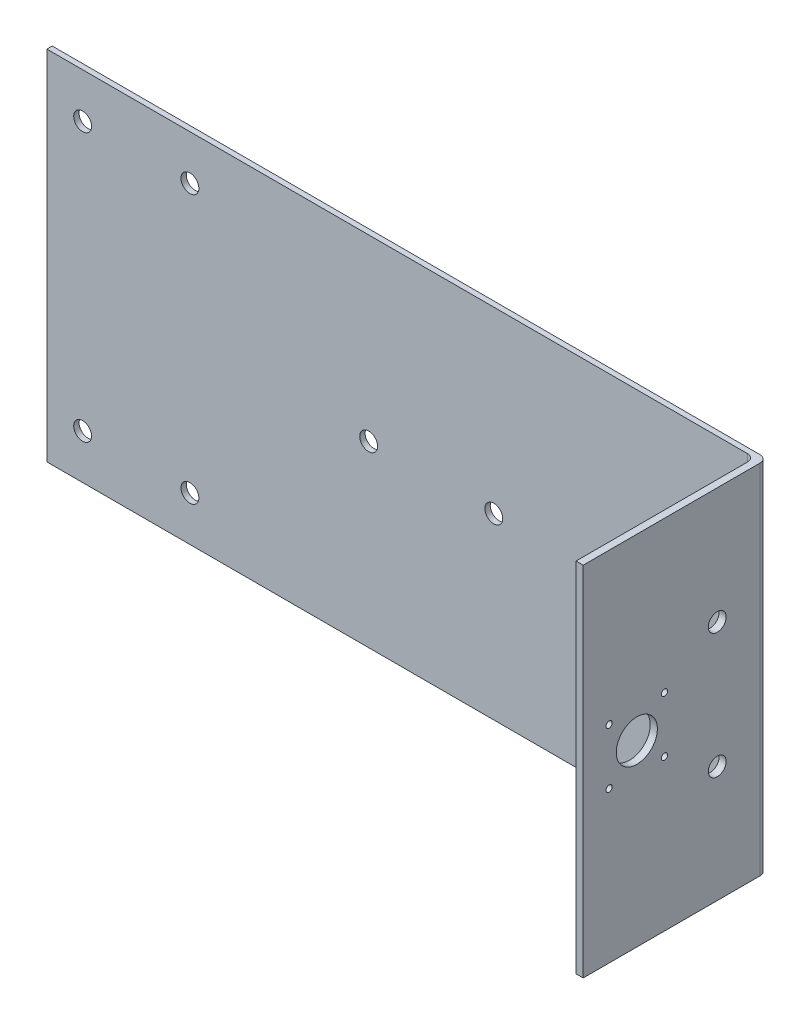
ISO-10303-21;
HEADER;
FILE_DESCRIPTION(('STEP AP214'),'2;1');
FILE_NAME('part.step','',(''),(''),'','','');
FILE_SCHEMA(('AUTOMOTIVE_DESIGN { 1 0 10303 214 1 1 1 1 }'));
ENDSEC;
DATA;
#1=APPLICATION_CONTEXT('core data for automotive mechanical design processes');
#2=APPLICATION_PROTOCOL_DEFINITION('international standard','automotive_design',2000,#1);
#3=PRODUCT_CONTEXT('',#1,'mechanical');
#4=PRODUCT('Part','Part','',(#3));
#5=PRODUCT_RELATED_PRODUCT_CATEGORY('part','',(#4));
#6=PRODUCT_DEFINITION_FORMATION('','',#4);
#7=PRODUCT_DEFINITION_CONTEXT('part definition',#1,'design');
#8=PRODUCT_DEFINITION('design','',#6,#7);
#9=PRODUCT_DEFINITION_SHAPE('','',#8);
#10=(LENGTH_UNIT() NAMED_UNIT(*) SI_UNIT(.MILLI.,.METRE.));
#11=(NAMED_UNIT(*) PLANE_ANGLE_UNIT() SI_UNIT($,.RADIAN.));
#12=(NAMED_UNIT(*) SI_UNIT($,.STERADIAN.) SOLID_ANGLE_UNIT());
#13=UNCERTAINTY_MEASURE_WITH_UNIT(LENGTH_MEASURE(1.E-05),#10,'distance_accuracy_value','');
#14=(GEOMETRIC_REPRESENTATION_CONTEXT(3) GLOBAL_UNCERTAINTY_ASSIGNED_CONTEXT((#13)) GLOBAL_UNIT_ASSIGNED_CONTEXT((#10,
#11,#12)) REPRESENTATION_CONTEXT('',''));
#15=CARTESIAN_POINT('',(0.,0.,0.));
#16=DIRECTION('',(0.,0.,1.));
#17=DIRECTION('',(1.,0.,0.));
#18=AXIS2_PLACEMENT_3D('',#15,#16,#17);
#19=CARTESIAN_POINT('',(-200.,-100.,3.));
#20=DIRECTION('',(1.,0.,0.));
#21=DIRECTION('',(0.,0.,-1.));
#22=AXIS2_PLACEMENT_3D('',#19,#20,#21);
#23=PLANE('',#22);
#24=DIRECTION('',(0.,-1.,0.));
#25=VECTOR('',#24,1.);
#26=CARTESIAN_POINT('',(-200.,-100.,0.));
#27=LINE('',#26,#25);
#28=CARTESIAN_POINT('',(-200.,100.,0.));
#29=VERTEX_POINT('',#28);
#30=CARTESIAN_POINT('',(-200.,-100.,0.));
#31=VERTEX_POINT('',#30);
#32=EDGE_CURVE('E229',#29,#31,#27,.T.);
#33=ORIENTED_EDGE('',*,*,#32,.T.);
#34=DIRECTION('',(0.,0.,-1.));
#35=VECTOR('',#34,1.);
#36=CARTESIAN_POINT('',(-200.,-100.,3.));
#37=LINE('',#36,#35);
#38=CARTESIAN_POINT('',(-200.,-100.,3.));
#39=VERTEX_POINT('',#38);
#40=EDGE_CURVE('E259',#39,#31,#37,.T.);
#41=ORIENTED_EDGE('',*,*,#40,.F.);
#42=DIRECTION('',(0.,-1.,0.));
#43=VECTOR('',#42,1.);
#44=CARTESIAN_POINT('',(-200.,-100.,3.));
#45=LINE('',#44,#43);
#46=CARTESIAN_POINT('',(-200.,100.,3.));
#47=VERTEX_POINT('',#46);
#48=EDGE_CURVE('E230',#47,#39,#45,.T.);
#49=ORIENTED_EDGE('',*,*,#48,.F.);
#50=DIRECTION('',(0.,0.,-1.));
#51=VECTOR('',#50,1.);
#52=CARTESIAN_POINT('',(-200.,100.,3.));
#53=LINE('',#52,#51);
#54=EDGE_CURVE('E241',#47,#29,#53,.T.);
#55=ORIENTED_EDGE('',*,*,#54,.T.);
#56=EDGE_LOOP('',(#33,#41,#49,#55));
#57=FACE_BOUND('',#56,.T.);
#58=ADVANCED_FACE('F41',(#57),#23,.F.);
#59=CARTESIAN_POINT('',(200.,-100.,3.));
#60=DIRECTION('',(0.,1.,0.));
#61=DIRECTION('',(-1.,0.,0.));
#62=AXIS2_PLACEMENT_3D('',#59,#60,#61);
#63=PLANE('',#62);
#64=DIRECTION('',(1.,0.,0.));
#65=VECTOR('',#64,1.);
#66=CARTESIAN_POINT('',(200.,-100.,0.));
#67=LINE('',#66,#65);
#68=CARTESIAN_POINT('',(196.,-100.,0.));
#69=VERTEX_POINT('',#68);
#70=EDGE_CURVE('E245',#31,#69,#67,.T.);
#71=ORIENTED_EDGE('',*,*,#70,.T.);
#72=CARTESIAN_POINT('',(196.,-100.,4.));
#73=DIRECTION('',(0.,1.,0.));
#74=DIRECTION('',(-1.,0.,0.));
#75=AXIS2_PLACEMENT_3D('',#72,#73,#74);
#76=CIRCLE('',#75,4.);
#77=CARTESIAN_POINT('',(200.,-100.,4.));
#78=VERTEX_POINT('',#77);
#79=EDGE_CURVE('E273',#69,#78,#76,.F.);
#80=ORIENTED_EDGE('',*,*,#79,.T.);
#81=DIRECTION('',(0.,0.,-1.));
#82=VECTOR('',#81,1.);
#83=CARTESIAN_POINT('',(200.,-100.,3.));
#84=LINE('',#83,#82);
#85=CARTESIAN_POINT('',(200.,-100.,103.));
#86=VERTEX_POINT('',#85);
#87=EDGE_CURVE('E122',#86,#78,#84,.T.);
#88=ORIENTED_EDGE('',*,*,#87,.F.);
#89=DIRECTION('',(1.,0.,0.));
#90=VECTOR('',#89,1.);
#91=CARTESIAN_POINT('',(196.,-100.,103.));
#92=LINE('',#91,#90);
#93=CARTESIAN_POINT('',(196.,-100.,103.));
#94=VERTEX_POINT('',#93);
#95=EDGE_CURVE('E118',#94,#86,#92,.T.);
#96=ORIENTED_EDGE('',*,*,#95,.F.);
#97=DIRECTION('',(0.,0.,-1.));
#98=VECTOR('',#97,1.);
#99=CARTESIAN_POINT('',(196.,-100.,93.));
#100=LINE('',#99,#98);
#101=CARTESIAN_POINT('',(196.,-100.,7.00000000000003));
#102=VERTEX_POINT('',#101);
#103=EDGE_CURVE('E106',#94,#102,#100,.T.);
#104=ORIENTED_EDGE('',*,*,#103,.T.);
#105=CARTESIAN_POINT('',(192.,-100.,7.00000000000001));
#106=DIRECTION('',(0.,1.,0.));
#107=DIRECTION('',(-1.,0.,0.));
#108=AXIS2_PLACEMENT_3D('',#105,#106,#107);
#109=CIRCLE('',#108,4.);
#110=CARTESIAN_POINT('',(192.,-100.,3.));
#111=VERTEX_POINT('',#110);
#112=EDGE_CURVE('E51',#102,#111,#109,.T.);
#113=ORIENTED_EDGE('',*,*,#112,.T.);
#114=DIRECTION('',(1.,0.,0.));
#115=VECTOR('',#114,1.);
#116=CARTESIAN_POINT('',(200.,-100.,3.));
#117=LINE('',#116,#115);
#118=EDGE_CURVE('E234',#39,#111,#117,.T.);
#119=ORIENTED_EDGE('',*,*,#118,.F.);
#120=ORIENTED_EDGE('',*,*,#40,.T.);
#121=EDGE_LOOP('',(#71,#80,#88,#96,#104,#113,#119,#120));
#122=FACE_BOUND('',#121,.T.);
#123=ADVANCED_FACE('F120',(#122),#63,.F.);
#124=CARTESIAN_POINT('',(200.,-100.,3.));
#125=DIRECTION('',(-1.,0.,0.));
#126=DIRECTION('',(0.,-1.,0.));
#127=AXIS2_PLACEMENT_3D('',#124,#125,#126);
#128=PLANE('',#127);
#129=CARTESIAN_POINT('',(200.,-35.,28.));
#130=DIRECTION('',(1.,0.,0.));
#131=DIRECTION('',(0.,1.,0.));
#132=AXIS2_PLACEMENT_3D('',#129,#130,#131);
#133=CIRCLE('',#132,5.);
#134=CARTESIAN_POINT('',(200.,-30.,28.));
#135=VERTEX_POINT('',#134);
#136=EDGE_CURVE('E141',#135,#135,#133,.T.);
#137=ORIENTED_EDGE('',*,*,#136,.F.);
#138=EDGE_LOOP('',(#137));
#139=FACE_BOUND('',#138,.T.);
#140=CARTESIAN_POINT('',(200.,35.,28.));
#141=DIRECTION('',(1.,0.,0.));
#142=DIRECTION('',(0.,-1.,0.));
#143=AXIS2_PLACEMENT_3D('',#140,#141,#142);
#144=CIRCLE('',#143,5.);
#145=CARTESIAN_POINT('',(200.,30.,28.));
#146=VERTEX_POINT('',#145);
#147=EDGE_CURVE('E140',#146,#146,#144,.T.);
#148=ORIENTED_EDGE('',*,*,#147,.F.);
#149=EDGE_LOOP('',(#148));
#150=FACE_BOUND('',#149,.T.);
#151=CARTESIAN_POINT('',(200.,15.5,88.5));
#152=DIRECTION('',(1.,0.,0.));
#153=DIRECTION('',(0.,1.,0.));
#154=AXIS2_PLACEMENT_3D('',#151,#152,#153);
#155=CIRCLE('',#154,1.75);
#156=CARTESIAN_POINT('',(200.,17.25,88.5));
#157=VERTEX_POINT('',#156);
#158=EDGE_CURVE('E158',#157,#157,#155,.T.);
#159=ORIENTED_EDGE('',*,*,#158,.F.);
#160=EDGE_LOOP('',(#159));
#161=FACE_BOUND('',#160,.T.);
#162=CARTESIAN_POINT('',(200.,-15.5,88.5));
#163=DIRECTION('',(1.,0.,0.));
#164=DIRECTION('',(0.,1.,0.));
#165=AXIS2_PLACEMENT_3D('',#162,#163,#164);
#166=CIRCLE('',#165,1.75);
#167=CARTESIAN_POINT('',(200.,-13.75,88.5));
#168=VERTEX_POINT('',#167);
#169=EDGE_CURVE('E154',#168,#168,#166,.T.);
#170=ORIENTED_EDGE('',*,*,#169,.F.);
#171=EDGE_LOOP('',(#170));
#172=FACE_BOUND('',#171,.T.);
#173=CARTESIAN_POINT('',(200.,-15.5,57.5));
#174=DIRECTION('',(1.,0.,0.));
#175=DIRECTION('',(0.,1.,0.));
#176=AXIS2_PLACEMENT_3D('',#173,#174,#175);
#177=CIRCLE('',#176,1.75);
#178=CARTESIAN_POINT('',(200.,-13.75,57.5));
#179=VERTEX_POINT('',#178);
#180=EDGE_CURVE('E149',#179,#179,#177,.T.);
#181=ORIENTED_EDGE('',*,*,#180,.F.);
#182=EDGE_LOOP('',(#181));
#183=FACE_BOUND('',#182,.T.);
#184=CARTESIAN_POINT('',(200.,15.5,57.5));
#185=DIRECTION('',(1.,0.,0.));
#186=DIRECTION('',(0.,1.,0.));
#187=AXIS2_PLACEMENT_3D('',#184,#185,#186);
#188=CIRCLE('',#187,1.75);
#189=CARTESIAN_POINT('',(200.,17.25,57.5));
#190=VERTEX_POINT('',#189);
#191=EDGE_CURVE('E153',#190,#190,#188,.T.);
#192=ORIENTED_EDGE('',*,*,#191,.F.);
#193=EDGE_LOOP('',(#192));
#194=FACE_BOUND('',#193,.T.);
#195=CARTESIAN_POINT('',(200.,0.,73.));
#196=DIRECTION('',(1.,0.,0.));
#197=DIRECTION('',(0.,1.,0.));
#198=AXIS2_PLACEMENT_3D('',#195,#196,#197);
#199=CIRCLE('',#198,11.5);
#200=CARTESIAN_POINT('',(200.,11.5,73.));
#201=VERTEX_POINT('',#200);
#202=EDGE_CURVE('E166',#201,#201,#199,.T.);
#203=ORIENTED_EDGE('',*,*,#202,.F.);
#204=EDGE_LOOP('',(#203));
#205=FACE_BOUND('',#204,.T.);
#206=ORIENTED_EDGE('',*,*,#87,.T.);
#207=DIRECTION('',(0.,1.,0.));
#208=VECTOR('',#207,1.);
#209=CARTESIAN_POINT('',(200.,-100.,4.));
#210=LINE('',#209,#208);
#211=CARTESIAN_POINT('',(200.,100.,4.));
#212=VERTEX_POINT('',#211);
#213=EDGE_CURVE('E263',#78,#212,#210,.T.);
#214=ORIENTED_EDGE('',*,*,#213,.T.);
#215=DIRECTION('',(0.,0.,-1.));
#216=VECTOR('',#215,1.);
#217=CARTESIAN_POINT('',(200.,100.,3.));
#218=LINE('',#217,#216);
#219=CARTESIAN_POINT('',(200.,100.,103.));
#220=VERTEX_POINT('',#219);
#221=EDGE_CURVE('E253',#220,#212,#218,.T.);
#222=ORIENTED_EDGE('',*,*,#221,.F.);
#223=DIRECTION('',(0.,1.,0.));
#224=VECTOR('',#223,1.);
#225=CARTESIAN_POINT('',(200.,-100.,103.));
#226=LINE('',#225,#224);
#227=EDGE_CURVE('E127',#86,#220,#226,.T.);
#228=ORIENTED_EDGE('',*,*,#227,.F.);
#229=EDGE_LOOP('',(#206,#214,#222,#228));
#230=FACE_BOUND('',#229,.T.);
#231=ADVANCED_FACE('F327',(#139,#150,#161,#172,#183,#194,#205,#230),#128,.F.);
#232=CARTESIAN_POINT('',(200.,100.,3.));
#233=DIRECTION('',(0.,-1.,0.));
#234=DIRECTION('',(1.,0.,0.));
#235=AXIS2_PLACEMENT_3D('',#232,#233,#234);
#236=PLANE('',#235);
#237=ORIENTED_EDGE('',*,*,#221,.T.);
#238=CARTESIAN_POINT('',(196.,100.,4.));
#239=DIRECTION('',(0.,-1.,0.));
#240=DIRECTION('',(1.,0.,0.));
#241=AXIS2_PLACEMENT_3D('',#238,#239,#240);
#242=CIRCLE('',#241,4.);
#243=CARTESIAN_POINT('',(196.,100.,0.));
#244=VERTEX_POINT('',#243);
#245=EDGE_CURVE('E267',#212,#244,#242,.F.);
#246=ORIENTED_EDGE('',*,*,#245,.T.);
#247=DIRECTION('',(-1.,0.,0.));
#248=VECTOR('',#247,1.);
#249=CARTESIAN_POINT('',(200.,100.,0.));
#250=LINE('',#249,#248);
#251=EDGE_CURVE('E235',#244,#29,#250,.T.);
#252=ORIENTED_EDGE('',*,*,#251,.T.);
#253=ORIENTED_EDGE('',*,*,#54,.F.);
#254=DIRECTION('',(-1.,0.,0.));
#255=VECTOR('',#254,1.);
#256=CARTESIAN_POINT('',(200.,100.,3.));
#257=LINE('',#256,#255);
#258=CARTESIAN_POINT('',(192.,100.,3.));
#259=VERTEX_POINT('',#258);
#260=EDGE_CURVE('E238',#259,#47,#257,.T.);
#261=ORIENTED_EDGE('',*,*,#260,.F.);
#262=CARTESIAN_POINT('',(192.,100.,7.00000000000001));
#263=DIRECTION('',(0.,-1.,0.));
#264=DIRECTION('',(1.,0.,0.));
#265=AXIS2_PLACEMENT_3D('',#262,#263,#264);
#266=CIRCLE('',#265,4.);
#267=CARTESIAN_POINT('',(196.,100.,7.00000000000003));
#268=VERTEX_POINT('',#267);
#269=EDGE_CURVE('E11',#259,#268,#266,.T.);
#270=ORIENTED_EDGE('',*,*,#269,.T.);
#271=DIRECTION('',(0.,0.,-1.));
#272=VECTOR('',#271,1.);
#273=CARTESIAN_POINT('',(196.,100.,93.));
#274=LINE('',#273,#272);
#275=CARTESIAN_POINT('',(196.,100.,103.));
#276=VERTEX_POINT('',#275);
#277=EDGE_CURVE('E114',#276,#268,#274,.T.);
#278=ORIENTED_EDGE('',*,*,#277,.F.);
#279=DIRECTION('',(-1.,0.,0.));
#280=VECTOR('',#279,1.);
#281=CARTESIAN_POINT('',(196.,100.,103.));
#282=LINE('',#281,#280);
#283=EDGE_CURVE('E132',#220,#276,#282,.T.);
#284=ORIENTED_EDGE('',*,*,#283,.F.);
#285=EDGE_LOOP('',(#237,#246,#252,#253,#261,#270,#278,#284));
#286=FACE_BOUND('',#285,.T.);
#287=ADVANCED_FACE('F345',(#286),#236,.F.);
#288=CARTESIAN_POINT('',(0.,0.,3.));
#289=DIRECTION('',(0.,0.,1.));
#290=DIRECTION('',(1.,0.,0.));
#291=AXIS2_PLACEMENT_3D('',#288,#289,#290);
#292=PLANE('',#291);
#293=ORIENTED_EDGE('',*,*,#118,.T.);
#294=DIRECTION('',(0.,-1.,0.));
#295=VECTOR('',#294,1.);
#296=CARTESIAN_POINT('',(192.,0.,3.));
#297=LINE('',#296,#295);
#298=EDGE_CURVE('E278',#111,#259,#297,.F.);
#299=ORIENTED_EDGE('',*,*,#298,.T.);
#300=ORIENTED_EDGE('',*,*,#260,.T.);
#301=ORIENTED_EDGE('',*,*,#48,.T.);
#302=EDGE_LOOP('',(#293,#299,#300,#301));
#303=FACE_BOUND('',#302,.T.);
#304=CARTESIAN_POINT('',(-180.,75.,3.));
#305=DIRECTION('',(0.,0.,1.));
#306=DIRECTION('',(1.,0.,0.));
#307=AXIS2_PLACEMENT_3D('',#304,#305,#306);
#308=CIRCLE('',#307,4.99999999999999);
#309=CARTESIAN_POINT('',(-175.,75.,3.));
#310=VERTEX_POINT('',#309);
#311=EDGE_CURVE('E225',#310,#310,#308,.T.);
#312=ORIENTED_EDGE('',*,*,#311,.F.);
#313=EDGE_LOOP('',(#312));
#314=FACE_BOUND('',#313,.T.);
#315=CARTESIAN_POINT('',(-120.,75.,3.));
#316=DIRECTION('',(0.,0.,1.));
#317=DIRECTION('',(1.,0.,0.));
#318=AXIS2_PLACEMENT_3D('',#315,#316,#317);
#319=CIRCLE('',#318,5.00000000000001);
#320=CARTESIAN_POINT('',(-115.,75.,3.));
#321=VERTEX_POINT('',#320);
#322=EDGE_CURVE('E221',#321,#321,#319,.T.);
#323=ORIENTED_EDGE('',*,*,#322,.F.);
#324=EDGE_LOOP('',(#323));
#325=FACE_BOUND('',#324,.T.);
#326=CARTESIAN_POINT('',(-120.,-75.,3.));
#327=DIRECTION('',(0.,0.,1.));
#328=DIRECTION('',(1.,0.,0.));
#329=AXIS2_PLACEMENT_3D('',#326,#327,#328);
#330=CIRCLE('',#329,5.00000000000001);
#331=CARTESIAN_POINT('',(-115.,-75.,3.));
#332=VERTEX_POINT('',#331);
#333=EDGE_CURVE('E217',#332,#332,#330,.T.);
#334=ORIENTED_EDGE('',*,*,#333,.F.);
#335=EDGE_LOOP('',(#334));
#336=FACE_BOUND('',#335,.T.);
#337=CARTESIAN_POINT('',(120.,0.,3.));
#338=DIRECTION('',(0.,0.,1.));
#339=DIRECTION('',(1.,0.,0.));
#340=AXIS2_PLACEMENT_3D('',#337,#338,#339);
#341=CIRCLE('',#340,5.);
#342=CARTESIAN_POINT('',(125.,0.,3.));
#343=VERTEX_POINT('',#342);
#344=EDGE_CURVE('E213',#343,#343,#341,.T.);
#345=ORIENTED_EDGE('',*,*,#344,.F.);
#346=EDGE_LOOP('',(#345));
#347=FACE_BOUND('',#346,.T.);
#348=CARTESIAN_POINT('',(50.0000000000001,0.,3.));
#349=DIRECTION('',(0.,0.,1.));
#350=DIRECTION('',(1.,0.,0.));
#351=AXIS2_PLACEMENT_3D('',#348,#349,#350);
#352=CIRCLE('',#351,5.);
#353=CARTESIAN_POINT('',(55.0000000000001,0.,3.));
#354=VERTEX_POINT('',#353);
#355=EDGE_CURVE('E209',#354,#354,#352,.T.);
#356=ORIENTED_EDGE('',*,*,#355,.F.);
#357=EDGE_LOOP('',(#356));
#358=FACE_BOUND('',#357,.T.);
#359=CARTESIAN_POINT('',(-20.,0.,3.));
#360=DIRECTION('',(0.,0.,1.));
#361=DIRECTION('',(1.,0.,0.));
#362=AXIS2_PLACEMENT_3D('',#359,#360,#361);
#363=CIRCLE('',#362,5.);
#364=CARTESIAN_POINT('',(-15.,0.,3.));
#365=VERTEX_POINT('',#364);
#366=EDGE_CURVE('E205',#365,#365,#363,.T.);
#367=ORIENTED_EDGE('',*,*,#366,.F.);
#368=EDGE_LOOP('',(#367));
#369=FACE_BOUND('',#368,.T.);
#370=CARTESIAN_POINT('',(-180.,-75.,3.));
#371=DIRECTION('',(0.,0.,1.));
#372=DIRECTION('',(1.,0.,0.));
#373=AXIS2_PLACEMENT_3D('',#370,#371,#372);
#374=CIRCLE('',#373,4.99999999999999);
#375=CARTESIAN_POINT('',(-175.,-75.,3.));
#376=VERTEX_POINT('',#375);
#377=EDGE_CURVE('E201',#376,#376,#374,.T.);
#378=ORIENTED_EDGE('',*,*,#377,.F.);
#379=EDGE_LOOP('',(#378));
#380=FACE_BOUND('',#379,.T.);
#381=ADVANCED_FACE('F349',(#303,#314,#325,#336,#347,#358,#369,#380),#292,.T.);
#382=CARTESIAN_POINT('',(0.,0.,0.));
#383=DIRECTION('',(0.,0.,1.));
#384=DIRECTION('',(1.,0.,0.));
#385=AXIS2_PLACEMENT_3D('',#382,#383,#384);
#386=PLANE('',#385);
#387=CARTESIAN_POINT('',(-180.,75.,0.));
#388=DIRECTION('',(0.,0.,-1.));
#389=DIRECTION('',(1.,0.,0.));
#390=AXIS2_PLACEMENT_3D('',#387,#388,#389);
#391=CIRCLE('',#390,4.99999999999999);
#392=CARTESIAN_POINT('',(-175.,75.,0.));
#393=VERTEX_POINT('',#392);
#394=EDGE_CURVE('E173',#393,#393,#391,.T.);
#395=ORIENTED_EDGE('',*,*,#394,.F.);
#396=EDGE_LOOP('',(#395));
#397=FACE_BOUND('',#396,.T.);
#398=CARTESIAN_POINT('',(-120.,75.,0.));
#399=DIRECTION('',(0.,0.,-1.));
#400=DIRECTION('',(1.,0.,0.));
#401=AXIS2_PLACEMENT_3D('',#398,#399,#400);
#402=CIRCLE('',#401,5.00000000000001);
#403=CARTESIAN_POINT('',(-115.,75.,0.));
#404=VERTEX_POINT('',#403);
#405=EDGE_CURVE('E183',#404,#404,#402,.T.);
#406=ORIENTED_EDGE('',*,*,#405,.F.);
#407=EDGE_LOOP('',(#406));
#408=FACE_BOUND('',#407,.T.);
#409=CARTESIAN_POINT('',(-120.,-75.,0.));
#410=DIRECTION('',(0.,0.,-1.));
#411=DIRECTION('',(-1.,0.,0.));
#412=AXIS2_PLACEMENT_3D('',#409,#410,#411);
#413=CIRCLE('',#412,5.00000000000001);
#414=CARTESIAN_POINT('',(-125.,-75.,0.));
#415=VERTEX_POINT('',#414);
#416=EDGE_CURVE('E184',#415,#415,#413,.T.);
#417=ORIENTED_EDGE('',*,*,#416,.F.);
#418=EDGE_LOOP('',(#417));
#419=FACE_BOUND('',#418,.T.);
#420=CARTESIAN_POINT('',(120.,0.,0.));
#421=DIRECTION('',(0.,0.,-1.));
#422=DIRECTION('',(-1.,0.,0.));
#423=AXIS2_PLACEMENT_3D('',#420,#421,#422);
#424=CIRCLE('',#423,5.);
#425=CARTESIAN_POINT('',(115.,0.,0.));
#426=VERTEX_POINT('',#425);
#427=EDGE_CURVE('E178',#426,#426,#424,.T.);
#428=ORIENTED_EDGE('',*,*,#427,.F.);
#429=EDGE_LOOP('',(#428));
#430=FACE_BOUND('',#429,.T.);
#431=CARTESIAN_POINT('',(50.0000000000001,0.,0.));
#432=DIRECTION('',(0.,0.,-1.));
#433=DIRECTION('',(-1.,0.,0.));
#434=AXIS2_PLACEMENT_3D('',#431,#432,#433);
#435=CIRCLE('',#434,5.);
#436=CARTESIAN_POINT('',(45.0000000000001,0.,0.));
#437=VERTEX_POINT('',#436);
#438=EDGE_CURVE('E174',#437,#437,#435,.T.);
#439=ORIENTED_EDGE('',*,*,#438,.F.);
#440=EDGE_LOOP('',(#439));
#441=FACE_BOUND('',#440,.T.);
#442=CARTESIAN_POINT('',(-20.,0.,0.));
#443=DIRECTION('',(0.,0.,-1.));
#444=DIRECTION('',(-1.,0.,0.));
#445=AXIS2_PLACEMENT_3D('',#442,#443,#444);
#446=CIRCLE('',#445,5.);
#447=CARTESIAN_POINT('',(-25.,0.,0.));
#448=VERTEX_POINT('',#447);
#449=EDGE_CURVE('E179',#448,#448,#446,.T.);
#450=ORIENTED_EDGE('',*,*,#449,.F.);
#451=EDGE_LOOP('',(#450));
#452=FACE_BOUND('',#451,.T.);
#453=CARTESIAN_POINT('',(-180.,-75.,0.));
#454=DIRECTION('',(0.,0.,-1.));
#455=DIRECTION('',(-1.,0.,0.));
#456=AXIS2_PLACEMENT_3D('',#453,#454,#455);
#457=CIRCLE('',#456,4.99999999999999);
#458=CARTESIAN_POINT('',(-185.,-75.,0.));
#459=VERTEX_POINT('',#458);
#460=EDGE_CURVE('E188',#459,#459,#457,.T.);
#461=ORIENTED_EDGE('',*,*,#460,.F.);
#462=EDGE_LOOP('',(#461));
#463=FACE_BOUND('',#462,.T.);
#464=ORIENTED_EDGE('',*,*,#251,.F.);
#465=DIRECTION('',(0.,1.,0.));
#466=VECTOR('',#465,1.);
#467=CARTESIAN_POINT('',(196.,0.,0.));
#468=LINE('',#467,#466);
#469=EDGE_CURVE('E270',#244,#69,#468,.F.);
#470=ORIENTED_EDGE('',*,*,#469,.T.);
#471=ORIENTED_EDGE('',*,*,#70,.F.);
#472=ORIENTED_EDGE('',*,*,#32,.F.);
#473=EDGE_LOOP('',(#464,#470,#471,#472));
#474=FACE_BOUND('',#473,.T.);
#475=ADVANCED_FACE('F357',(#397,#408,#419,#430,#441,#452,#463,#474),#386,.F.);
#476=CARTESIAN_POINT('',(-180.,-75.,10.));
#477=DIRECTION('',(0.,0.,-1.));
#478=DIRECTION('',(-1.,0.,0.));
#479=AXIS2_PLACEMENT_3D('',#476,#477,#478);
#480=CYLINDRICAL_SURFACE('',#479,4.99999999999999);
#481=ORIENTED_EDGE('',*,*,#377,.T.);
#482=EDGE_LOOP('',(#481));
#483=FACE_BOUND('',#482,.T.);
#484=ORIENTED_EDGE('',*,*,#460,.T.);
#485=EDGE_LOOP('',(#484));
#486=FACE_BOUND('',#485,.T.);
#487=ADVANCED_FACE('F359',(#483,#486),#480,.F.);
#488=CARTESIAN_POINT('',(-20.,0.,10.));
#489=DIRECTION('',(0.,0.,-1.));
#490=DIRECTION('',(-1.,0.,0.));
#491=AXIS2_PLACEMENT_3D('',#488,#489,#490);
#492=CYLINDRICAL_SURFACE('',#491,5.);
#493=ORIENTED_EDGE('',*,*,#366,.T.);
#494=EDGE_LOOP('',(#493));
#495=FACE_BOUND('',#494,.T.);
#496=ORIENTED_EDGE('',*,*,#449,.T.);
#497=EDGE_LOOP('',(#496));
#498=FACE_BOUND('',#497,.T.);
#499=ADVANCED_FACE('F365',(#495,#498),#492,.F.);
#500=CARTESIAN_POINT('',(50.0000000000001,0.,10.));
#501=DIRECTION('',(0.,0.,-1.));
#502=DIRECTION('',(-1.,0.,0.));
#503=AXIS2_PLACEMENT_3D('',#500,#501,#502);
#504=CYLINDRICAL_SURFACE('',#503,5.);
#505=ORIENTED_EDGE('',*,*,#355,.T.);
#506=EDGE_LOOP('',(#505));
#507=FACE_BOUND('',#506,.T.);
#508=ORIENTED_EDGE('',*,*,#438,.T.);
#509=EDGE_LOOP('',(#508));
#510=FACE_BOUND('',#509,.T.);
#511=ADVANCED_FACE('F404',(#507,#510),#504,.F.);
#512=CARTESIAN_POINT('',(120.,0.,10.));
#513=DIRECTION('',(0.,0.,-1.));
#514=DIRECTION('',(-1.,0.,0.));
#515=AXIS2_PLACEMENT_3D('',#512,#513,#514);
#516=CYLINDRICAL_SURFACE('',#515,5.);
#517=ORIENTED_EDGE('',*,*,#344,.T.);
#518=EDGE_LOOP('',(#517));
#519=FACE_BOUND('',#518,.T.);
#520=ORIENTED_EDGE('',*,*,#427,.T.);
#521=EDGE_LOOP('',(#520));
#522=FACE_BOUND('',#521,.T.);
#523=ADVANCED_FACE('F407',(#519,#522),#516,.F.);
#524=CARTESIAN_POINT('',(-120.,-75.,10.));
#525=DIRECTION('',(0.,0.,-1.));
#526=DIRECTION('',(-1.,0.,0.));
#527=AXIS2_PLACEMENT_3D('',#524,#525,#526);
#528=CYLINDRICAL_SURFACE('',#527,5.00000000000001);
#529=ORIENTED_EDGE('',*,*,#333,.T.);
#530=EDGE_LOOP('',(#529));
#531=FACE_BOUND('',#530,.T.);
#532=ORIENTED_EDGE('',*,*,#416,.T.);
#533=EDGE_LOOP('',(#532));
#534=FACE_BOUND('',#533,.T.);
#535=ADVANCED_FACE('F412',(#531,#534),#528,.F.);
#536=CARTESIAN_POINT('',(-120.,75.,10.));
#537=DIRECTION('',(0.,0.,-1.));
#538=DIRECTION('',(-1.,0.,0.));
#539=AXIS2_PLACEMENT_3D('',#536,#537,#538);
#540=CYLINDRICAL_SURFACE('',#539,5.00000000000001);
#541=ORIENTED_EDGE('',*,*,#322,.T.);
#542=EDGE_LOOP('',(#541));
#543=FACE_BOUND('',#542,.T.);
#544=ORIENTED_EDGE('',*,*,#405,.T.);
#545=EDGE_LOOP('',(#544));
#546=FACE_BOUND('',#545,.T.);
#547=ADVANCED_FACE('F415',(#543,#546),#540,.F.);
#548=CARTESIAN_POINT('',(-180.,75.,10.));
#549=DIRECTION('',(0.,0.,-1.));
#550=DIRECTION('',(-1.,0.,0.));
#551=AXIS2_PLACEMENT_3D('',#548,#549,#550);
#552=CYLINDRICAL_SURFACE('',#551,4.99999999999999);
#553=ORIENTED_EDGE('',*,*,#311,.T.);
#554=EDGE_LOOP('',(#553));
#555=FACE_BOUND('',#554,.T.);
#556=ORIENTED_EDGE('',*,*,#394,.T.);
#557=EDGE_LOOP('',(#556));
#558=FACE_BOUND('',#557,.T.);
#559=ADVANCED_FACE('F338',(#555,#558),#552,.F.);
#560=CARTESIAN_POINT('',(196.,100.,93.));
#561=DIRECTION('',(1.,0.,0.));
#562=DIRECTION('',(0.,0.,-1.));
#563=AXIS2_PLACEMENT_3D('',#560,#561,#562);
#564=PLANE('',#563);
#565=CARTESIAN_POINT('',(196.,-35.,28.));
#566=DIRECTION('',(1.,0.,0.));
#567=DIRECTION('',(0.,0.,-1.));
#568=AXIS2_PLACEMENT_3D('',#565,#566,#567);
#569=CIRCLE('',#568,5.);
#570=CARTESIAN_POINT('',(196.,-35.,23.));
#571=VERTEX_POINT('',#570);
#572=EDGE_CURVE('E45',#571,#571,#569,.T.);
#573=ORIENTED_EDGE('',*,*,#572,.T.);
#574=EDGE_LOOP('',(#573));
#575=FACE_BOUND('',#574,.T.);
#576=CARTESIAN_POINT('',(196.,35.,28.));
#577=DIRECTION('',(1.,0.,0.));
#578=DIRECTION('',(0.,0.,-1.));
#579=AXIS2_PLACEMENT_3D('',#576,#577,#578);
#580=CIRCLE('',#579,5.);
#581=CARTESIAN_POINT('',(196.,35.,23.));
#582=VERTEX_POINT('',#581);
#583=EDGE_CURVE('E145',#582,#582,#580,.T.);
#584=ORIENTED_EDGE('',*,*,#583,.T.);
#585=EDGE_LOOP('',(#584));
#586=FACE_BOUND('',#585,.T.);
#587=CARTESIAN_POINT('',(196.,15.5,88.5));
#588=DIRECTION('',(1.,0.,0.));
#589=DIRECTION('',(0.,0.,-1.));
#590=AXIS2_PLACEMENT_3D('',#587,#588,#589);
#591=CIRCLE('',#590,1.75);
#592=CARTESIAN_POINT('',(196.,15.5,86.75));
#593=VERTEX_POINT('',#592);
#594=EDGE_CURVE('E169',#593,#593,#591,.T.);
#595=ORIENTED_EDGE('',*,*,#594,.T.);
#596=EDGE_LOOP('',(#595));
#597=FACE_BOUND('',#596,.T.);
#598=CARTESIAN_POINT('',(196.,-15.5,88.5));
#599=DIRECTION('',(1.,0.,0.));
#600=DIRECTION('',(0.,0.,-1.));
#601=AXIS2_PLACEMENT_3D('',#598,#599,#600);
#602=CIRCLE('',#601,1.75);
#603=CARTESIAN_POINT('',(196.,-15.5,86.75));
#604=VERTEX_POINT('',#603);
#605=EDGE_CURVE('E293',#604,#604,#602,.T.);
#606=ORIENTED_EDGE('',*,*,#605,.T.);
#607=EDGE_LOOP('',(#606));
#608=FACE_BOUND('',#607,.T.);
#609=CARTESIAN_POINT('',(196.,-15.5,57.5));
#610=DIRECTION('',(1.,0.,0.));
#611=DIRECTION('',(0.,0.,-1.));
#612=AXIS2_PLACEMENT_3D('',#609,#610,#611);
#613=CIRCLE('',#612,1.75);
#614=CARTESIAN_POINT('',(196.,-15.5,55.75));
#615=VERTEX_POINT('',#614);
#616=EDGE_CURVE('E289',#615,#615,#613,.T.);
#617=ORIENTED_EDGE('',*,*,#616,.T.);
#618=EDGE_LOOP('',(#617));
#619=FACE_BOUND('',#618,.T.);
#620=CARTESIAN_POINT('',(196.,15.5,57.5));
#621=DIRECTION('',(1.,0.,0.));
#622=DIRECTION('',(0.,0.,-1.));
#623=AXIS2_PLACEMENT_3D('',#620,#621,#622);
#624=CIRCLE('',#623,1.75);
#625=CARTESIAN_POINT('',(196.,15.5,55.75));
#626=VERTEX_POINT('',#625);
#627=EDGE_CURVE('E165',#626,#626,#624,.T.);
#628=ORIENTED_EDGE('',*,*,#627,.T.);
#629=EDGE_LOOP('',(#628));
#630=FACE_BOUND('',#629,.T.);
#631=CARTESIAN_POINT('',(196.,0.,73.));
#632=DIRECTION('',(1.,0.,0.));
#633=DIRECTION('',(0.,0.,-1.));
#634=AXIS2_PLACEMENT_3D('',#631,#632,#633);
#635=CIRCLE('',#634,11.5);
#636=CARTESIAN_POINT('',(196.,0.,61.5));
#637=VERTEX_POINT('',#636);
#638=EDGE_CURVE('E115',#637,#637,#635,.T.);
#639=ORIENTED_EDGE('',*,*,#638,.T.);
#640=EDGE_LOOP('',(#639));
#641=FACE_BOUND('',#640,.T.);
#642=ORIENTED_EDGE('',*,*,#277,.T.);
#643=DIRECTION('',(0.,-1.,0.));
#644=VECTOR('',#643,1.);
#645=CARTESIAN_POINT('',(196.,100.,7.00000000000001));
#646=LINE('',#645,#644);
#647=EDGE_CURVE('E112',#268,#102,#646,.T.);
#648=ORIENTED_EDGE('',*,*,#647,.T.);
#649=ORIENTED_EDGE('',*,*,#103,.F.);
#650=DIRECTION('',(0.,-1.,0.));
#651=VECTOR('',#650,1.);
#652=CARTESIAN_POINT('',(196.,-100.,103.));
#653=LINE('',#652,#651);
#654=EDGE_CURVE('E111',#276,#94,#653,.T.);
#655=ORIENTED_EDGE('',*,*,#654,.F.);
#656=EDGE_LOOP('',(#642,#648,#649,#655));
#657=FACE_BOUND('',#656,.T.);
#658=ADVANCED_FACE('F109',(#575,#586,#597,#608,#619,#630,#641,#657),#564,.F.);
#659=CARTESIAN_POINT('',(196.,-100.,4.));
#660=DIRECTION('',(0.,1.,0.));
#661=DIRECTION('',(-1.,0.,0.));
#662=AXIS2_PLACEMENT_3D('',#659,#660,#661);
#663=CYLINDRICAL_SURFACE('',#662,4.);
#664=ORIENTED_EDGE('',*,*,#79,.F.);
#665=ORIENTED_EDGE('',*,*,#469,.F.);
#666=ORIENTED_EDGE('',*,*,#245,.F.);
#667=ORIENTED_EDGE('',*,*,#213,.F.);
#668=EDGE_LOOP('',(#664,#665,#666,#667));
#669=FACE_BOUND('',#668,.T.);
#670=ADVANCED_FACE('F330',(#669),#663,.T.);
#671=CARTESIAN_POINT('',(192.,100.,7.00000000000001));
#672=DIRECTION('',(0.,-1.,0.));
#673=DIRECTION('',(0.,0.,-1.));
#674=AXIS2_PLACEMENT_3D('',#671,#672,#673);
#675=CYLINDRICAL_SURFACE('',#674,4.);
#676=ORIENTED_EDGE('',*,*,#269,.F.);
#677=ORIENTED_EDGE('',*,*,#298,.F.);
#678=ORIENTED_EDGE('',*,*,#112,.F.);
#679=ORIENTED_EDGE('',*,*,#647,.F.);
#680=EDGE_LOOP('',(#676,#677,#678,#679));
#681=FACE_BOUND('',#680,.T.);
#682=ADVANCED_FACE('F43',(#681),#675,.F.);
#683=CARTESIAN_POINT('',(110.,0.,73.));
#684=DIRECTION('',(1.,0.,0.));
#685=DIRECTION('',(0.,1.,0.));
#686=AXIS2_PLACEMENT_3D('',#683,#684,#685);
#687=CYLINDRICAL_SURFACE('',#686,11.5);
#688=ORIENTED_EDGE('',*,*,#202,.T.);
#689=EDGE_LOOP('',(#688));
#690=FACE_BOUND('',#689,.T.);
#691=ORIENTED_EDGE('',*,*,#638,.F.);
#692=EDGE_LOOP('',(#691));
#693=FACE_BOUND('',#692,.T.);
#694=ADVANCED_FACE('F336',(#690,#693),#687,.F.);
#695=CARTESIAN_POINT('',(110.,15.5,57.5));
#696=DIRECTION('',(1.,0.,0.));
#697=DIRECTION('',(0.,1.,0.));
#698=AXIS2_PLACEMENT_3D('',#695,#696,#697);
#699=CYLINDRICAL_SURFACE('',#698,1.75);
#700=ORIENTED_EDGE('',*,*,#191,.T.);
#701=EDGE_LOOP('',(#700));
#702=FACE_BOUND('',#701,.T.);
#703=ORIENTED_EDGE('',*,*,#627,.F.);
#704=EDGE_LOOP('',(#703));
#705=FACE_BOUND('',#704,.T.);
#706=ADVANCED_FACE('F393',(#702,#705),#699,.F.);
#707=CARTESIAN_POINT('',(110.,-15.5,57.5));
#708=DIRECTION('',(1.,0.,0.));
#709=DIRECTION('',(0.,1.,0.));
#710=AXIS2_PLACEMENT_3D('',#707,#708,#709);
#711=CYLINDRICAL_SURFACE('',#710,1.75);
#712=ORIENTED_EDGE('',*,*,#180,.T.);
#713=EDGE_LOOP('',(#712));
#714=FACE_BOUND('',#713,.T.);
#715=ORIENTED_EDGE('',*,*,#616,.F.);
#716=EDGE_LOOP('',(#715));
#717=FACE_BOUND('',#716,.T.);
#718=ADVANCED_FACE('F399',(#714,#717),#711,.F.);
#719=CARTESIAN_POINT('',(110.,-15.5,88.5));
#720=DIRECTION('',(1.,0.,0.));
#721=DIRECTION('',(0.,1.,0.));
#722=AXIS2_PLACEMENT_3D('',#719,#720,#721);
#723=CYLINDRICAL_SURFACE('',#722,1.75);
#724=ORIENTED_EDGE('',*,*,#169,.T.);
#725=EDGE_LOOP('',(#724));
#726=FACE_BOUND('',#725,.T.);
#727=ORIENTED_EDGE('',*,*,#605,.F.);
#728=EDGE_LOOP('',(#727));
#729=FACE_BOUND('',#728,.T.);
#730=ADVANCED_FACE('F523',(#726,#729),#723,.F.);
#731=CARTESIAN_POINT('',(110.,15.5,88.5));
#732=DIRECTION('',(1.,0.,0.));
#733=DIRECTION('',(0.,1.,0.));
#734=AXIS2_PLACEMENT_3D('',#731,#732,#733);
#735=CYLINDRICAL_SURFACE('',#734,1.75);
#736=ORIENTED_EDGE('',*,*,#158,.T.);
#737=EDGE_LOOP('',(#736));
#738=FACE_BOUND('',#737,.T.);
#739=ORIENTED_EDGE('',*,*,#594,.F.);
#740=EDGE_LOOP('',(#739));
#741=FACE_BOUND('',#740,.T.);
#742=ADVANCED_FACE('F318',(#738,#741),#735,.F.);
#743=CARTESIAN_POINT('',(185.,35.,28.));
#744=DIRECTION('',(1.,0.,0.));
#745=DIRECTION('',(0.,1.,0.));
#746=AXIS2_PLACEMENT_3D('',#743,#744,#745);
#747=CYLINDRICAL_SURFACE('',#746,5.);
#748=ORIENTED_EDGE('',*,*,#147,.T.);
#749=EDGE_LOOP('',(#748));
#750=FACE_BOUND('',#749,.T.);
#751=ORIENTED_EDGE('',*,*,#583,.F.);
#752=EDGE_LOOP('',(#751));
#753=FACE_BOUND('',#752,.T.);
#754=ADVANCED_FACE('F310',(#750,#753),#747,.F.);
#755=CARTESIAN_POINT('',(185.,-35.,28.));
#756=DIRECTION('',(1.,0.,0.));
#757=DIRECTION('',(0.,1.,0.));
#758=AXIS2_PLACEMENT_3D('',#755,#756,#757);
#759=CYLINDRICAL_SURFACE('',#758,5.);
#760=ORIENTED_EDGE('',*,*,#136,.T.);
#761=EDGE_LOOP('',(#760));
#762=FACE_BOUND('',#761,.T.);
#763=ORIENTED_EDGE('',*,*,#572,.F.);
#764=EDGE_LOOP('',(#763));
#765=FACE_BOUND('',#764,.T.);
#766=ADVANCED_FACE('F308',(#762,#765),#759,.F.);
#767=CARTESIAN_POINT('',(0.,0.,103.));
#768=DIRECTION('',(0.,0.,-1.));
#769=DIRECTION('',(-1.,0.,0.));
#770=AXIS2_PLACEMENT_3D('',#767,#768,#769);
#771=PLANE('',#770);
#772=ORIENTED_EDGE('',*,*,#654,.T.);
#773=ORIENTED_EDGE('',*,*,#95,.T.);
#774=ORIENTED_EDGE('',*,*,#227,.T.);
#775=ORIENTED_EDGE('',*,*,#283,.T.);
#776=EDGE_LOOP('',(#772,#773,#774,#775));
#777=FACE_BOUND('',#776,.T.);
#778=ADVANCED_FACE('F130',(#777),#771,.F.);
#779=CLOSED_SHELL('',(#58,#123,#231,#287,#381,#475,#487,#499,#511,#523,#535,#547,#559,#658,#670,
#682,#694,#706,#718,#730,#742,#754,#766,#778));
#780=MANIFOLD_SOLID_BREP('B2',#779);
#781=ADVANCED_BREP_SHAPE_REPRESENTATION('',(#18,#780),#14);
#782=SHAPE_DEFINITION_REPRESENTATION(#9,#781);
ENDSEC;
END-ISO-10303-21;
